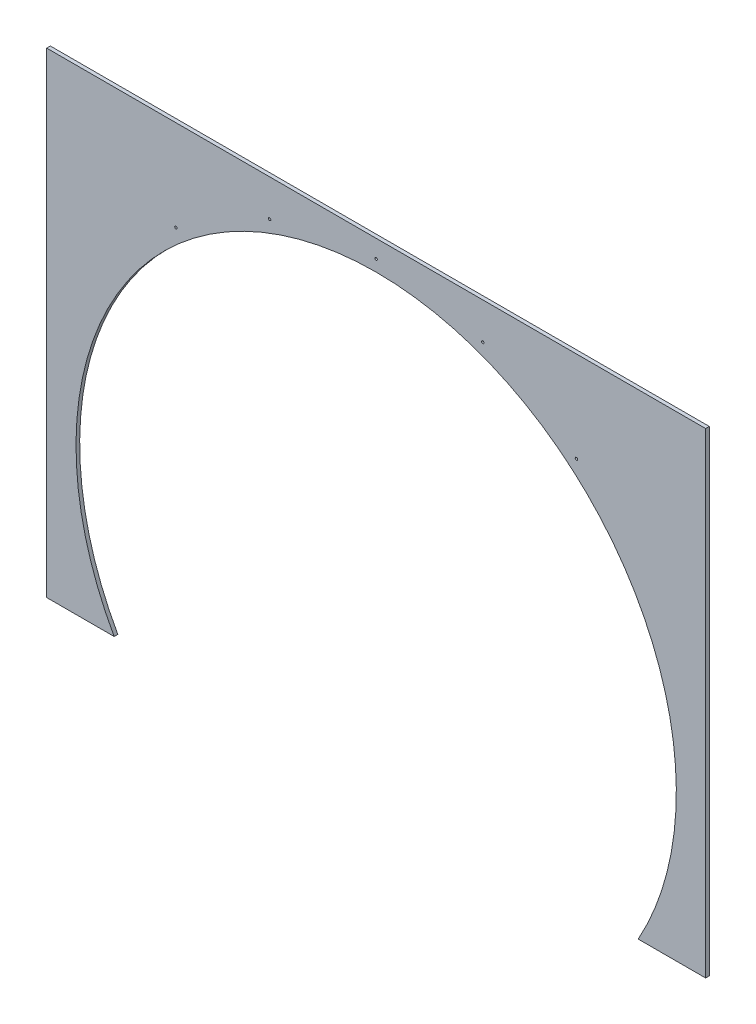
ISO-10303-21;
HEADER;
FILE_DESCRIPTION(('STEP AP214'),'2;1');
FILE_NAME('part.step','',(''),(''),'','','');
FILE_SCHEMA(('AUTOMOTIVE_DESIGN { 1 0 10303 214 1 1 1 1 }'));
ENDSEC;
DATA;
#1=APPLICATION_CONTEXT('core data for automotive mechanical design processes');
#2=APPLICATION_PROTOCOL_DEFINITION('international standard','automotive_design',2000,#1);
#3=PRODUCT_CONTEXT('',#1,'mechanical');
#4=PRODUCT('Part','Part','',(#3));
#5=PRODUCT_RELATED_PRODUCT_CATEGORY('part','',(#4));
#6=PRODUCT_DEFINITION_FORMATION('','',#4);
#7=PRODUCT_DEFINITION_CONTEXT('part definition',#1,'design');
#8=PRODUCT_DEFINITION('design','',#6,#7);
#9=PRODUCT_DEFINITION_SHAPE('','',#8);
#10=(LENGTH_UNIT() NAMED_UNIT(*) SI_UNIT(.MILLI.,.METRE.));
#11=(NAMED_UNIT(*) PLANE_ANGLE_UNIT() SI_UNIT($,.RADIAN.));
#12=(NAMED_UNIT(*) SI_UNIT($,.STERADIAN.) SOLID_ANGLE_UNIT());
#13=UNCERTAINTY_MEASURE_WITH_UNIT(LENGTH_MEASURE(1.E-05),#10,'distance_accuracy_value','');
#14=(GEOMETRIC_REPRESENTATION_CONTEXT(3) GLOBAL_UNCERTAINTY_ASSIGNED_CONTEXT((#13)) GLOBAL_UNIT_ASSIGNED_CONTEXT((#10,
#11,#12)) REPRESENTATION_CONTEXT('',''));
#15=CARTESIAN_POINT('',(0.,0.,0.));
#16=DIRECTION('',(0.,0.,1.));
#17=DIRECTION('',(1.,0.,0.));
#18=AXIS2_PLACEMENT_3D('',#15,#16,#17);
#19=CARTESIAN_POINT('',(0.,400.,10.));
#20=DIRECTION('',(0.,0.,1.));
#21=DIRECTION('',(1.,0.,0.));
#22=AXIS2_PLACEMENT_3D('',#19,#20,#21);
#23=PLANE('',#22);
#24=CARTESIAN_POINT('',(-291.096591753976,1199.78131272425,10.));
#25=DIRECTION('',(0.,0.,1.));
#26=DIRECTION('',(1.,0.,0.));
#27=AXIS2_PLACEMENT_3D('',#24,#25,#26);
#28=CIRCLE('',#27,3.29999999999997);
#29=CARTESIAN_POINT('',(-287.796591753976,1199.78131272425,10.));
#30=VERTEX_POINT('',#29);
#31=EDGE_CURVE('E149',#30,#30,#28,.F.);
#32=ORIENTED_EDGE('',*,*,#31,.T.);
#33=EDGE_LOOP('',(#32));
#34=FACE_BOUND('',#33,.T.);
#35=DIRECTION('',(0.,-1.,0.));
#36=VECTOR('',#35,1.);
#37=CARTESIAN_POINT('',(-900.,0.,10.));
#38=LINE('',#37,#36);
#39=CARTESIAN_POINT('',(-900.,1300.,10.));
#40=VERTEX_POINT('',#39);
#41=CARTESIAN_POINT('',(-900.,0.,10.));
#42=VERTEX_POINT('',#41);
#43=EDGE_CURVE('E131',#40,#42,#38,.T.);
#44=ORIENTED_EDGE('',*,*,#43,.T.);
#45=DIRECTION('',(1.,0.,0.));
#46=VECTOR('',#45,1.);
#47=CARTESIAN_POINT('',(-900.,0.,10.));
#48=LINE('',#47,#46);
#49=CARTESIAN_POINT('',(-715.821206726931,0.,10.));
#50=VERTEX_POINT('',#49);
#51=EDGE_CURVE('E89',#42,#50,#48,.T.);
#52=ORIENTED_EDGE('',*,*,#51,.T.);
#53=CARTESIAN_POINT('',(0.,400.,10.));
#54=DIRECTION('',(0.,0.,-1.));
#55=DIRECTION('',(1.,0.,0.));
#56=AXIS2_PLACEMENT_3D('',#53,#54,#55);
#57=CIRCLE('',#56,820.);
#58=CARTESIAN_POINT('',(715.821206726931,-3.88578058618805E-13,10.));
#59=VERTEX_POINT('',#58);
#60=EDGE_CURVE('E102',#50,#59,#57,.T.);
#61=ORIENTED_EDGE('',*,*,#60,.T.);
#62=DIRECTION('',(1.,0.,0.));
#63=VECTOR('',#62,1.);
#64=CARTESIAN_POINT('',(715.821206726931,0.,10.));
#65=LINE('',#64,#63);
#66=CARTESIAN_POINT('',(900.,0.,10.));
#67=VERTEX_POINT('',#66);
#68=EDGE_CURVE('E96',#59,#67,#65,.T.);
#69=ORIENTED_EDGE('',*,*,#68,.T.);
#70=DIRECTION('',(0.,1.,0.));
#71=VECTOR('',#70,1.);
#72=CARTESIAN_POINT('',(900.,0.,10.));
#73=LINE('',#72,#71);
#74=CARTESIAN_POINT('',(900.,1300.,10.));
#75=VERTEX_POINT('',#74);
#76=EDGE_CURVE('E100',#67,#75,#73,.T.);
#77=ORIENTED_EDGE('',*,*,#76,.T.);
#78=DIRECTION('',(-1.,0.,0.));
#79=VECTOR('',#78,1.);
#80=CARTESIAN_POINT('',(-900.,1300.,10.));
#81=LINE('',#80,#79);
#82=EDGE_CURVE('E52',#75,#40,#81,.T.);
#83=ORIENTED_EDGE('',*,*,#82,.T.);
#84=EDGE_LOOP('',(#44,#52,#61,#69,#77,#83));
#85=FACE_BOUND('',#84,.T.);
#86=CARTESIAN_POINT('',(547.082638414246,1051.98769977608,10.));
#87=DIRECTION('',(0.,0.,1.));
#88=DIRECTION('',(1.,0.,0.));
#89=AXIS2_PLACEMENT_3D('',#86,#87,#88);
#90=CIRCLE('',#89,3.29999999999997);
#91=CARTESIAN_POINT('',(550.382638414246,1051.98769977608,10.));
#92=VERTEX_POINT('',#91);
#93=EDGE_CURVE('E139',#92,#92,#90,.F.);
#94=ORIENTED_EDGE('',*,*,#93,.T.);
#95=EDGE_LOOP('',(#94));
#96=FACE_BOUND('',#95,.T.);
#97=CARTESIAN_POINT('',(291.096591753964,1199.78131272422,10.));
#98=DIRECTION('',(0.,0.,1.));
#99=DIRECTION('',(1.,0.,0.));
#100=AXIS2_PLACEMENT_3D('',#97,#98,#99);
#101=CIRCLE('',#100,3.29999999999997);
#102=CARTESIAN_POINT('',(294.396591753964,1199.78131272422,10.));
#103=VERTEX_POINT('',#102);
#104=EDGE_CURVE('E143',#103,#103,#101,.F.);
#105=ORIENTED_EDGE('',*,*,#104,.T.);
#106=EDGE_LOOP('',(#105));
#107=FACE_BOUND('',#106,.T.);
#108=CARTESIAN_POINT('',(-547.082638414294,1051.98769977616,10.));
#109=DIRECTION('',(0.,0.,1.));
#110=DIRECTION('',(1.,0.,0.));
#111=AXIS2_PLACEMENT_3D('',#108,#109,#110);
#112=CIRCLE('',#111,3.29999999999997);
#113=CARTESIAN_POINT('',(-543.782638414294,1051.98769977616,10.));
#114=VERTEX_POINT('',#113);
#115=EDGE_CURVE('E146',#114,#114,#112,.F.);
#116=ORIENTED_EDGE('',*,*,#115,.T.);
#117=EDGE_LOOP('',(#116));
#118=FACE_BOUND('',#117,.T.);
#119=CARTESIAN_POINT('',(0.,1251.10949584275,10.));
#120=DIRECTION('',(0.,0.,1.));
#121=DIRECTION('',(1.,0.,0.));
#122=AXIS2_PLACEMENT_3D('',#119,#120,#121);
#123=CIRCLE('',#122,3.29999999999999);
#124=CARTESIAN_POINT('',(3.30000000000002,1251.10949584275,10.));
#125=VERTEX_POINT('',#124);
#126=EDGE_CURVE('E159',#125,#125,#123,.F.);
#127=ORIENTED_EDGE('',*,*,#126,.T.);
#128=EDGE_LOOP('',(#127));
#129=FACE_BOUND('',#128,.T.);
#130=ADVANCED_FACE('F33',(#34,#85,#96,#107,#118,#129),#23,.T.);
#131=CARTESIAN_POINT('',(-900.,0.,10.));
#132=DIRECTION('',(1.,0.,0.));
#133=DIRECTION('',(0.,0.,-1.));
#134=AXIS2_PLACEMENT_3D('',#131,#132,#133);
#135=PLANE('',#134);
#136=DIRECTION('',(0.,-1.,0.));
#137=VECTOR('',#136,1.);
#138=CARTESIAN_POINT('',(-900.,0.,0.));
#139=LINE('',#138,#137);
#140=CARTESIAN_POINT('',(-900.,1300.,0.));
#141=VERTEX_POINT('',#140);
#142=CARTESIAN_POINT('',(-900.,0.,0.));
#143=VERTEX_POINT('',#142);
#144=EDGE_CURVE('E120',#141,#143,#139,.T.);
#145=ORIENTED_EDGE('',*,*,#144,.T.);
#146=DIRECTION('',(0.,0.,-1.));
#147=VECTOR('',#146,1.);
#148=CARTESIAN_POINT('',(-900.,0.,10.));
#149=LINE('',#148,#147);
#150=EDGE_CURVE('E11',#42,#143,#149,.T.);
#151=ORIENTED_EDGE('',*,*,#150,.F.);
#152=ORIENTED_EDGE('',*,*,#43,.F.);
#153=DIRECTION('',(0.,0.,-1.));
#154=VECTOR('',#153,1.);
#155=CARTESIAN_POINT('',(-900.,1300.,10.));
#156=LINE('',#155,#154);
#157=EDGE_CURVE('E116',#40,#141,#156,.T.);
#158=ORIENTED_EDGE('',*,*,#157,.T.);
#159=EDGE_LOOP('',(#145,#151,#152,#158));
#160=FACE_BOUND('',#159,.T.);
#161=ADVANCED_FACE('F35',(#160),#135,.F.);
#162=CARTESIAN_POINT('',(-900.,0.,10.));
#163=DIRECTION('',(0.,1.,0.));
#164=DIRECTION('',(-1.,0.,0.));
#165=AXIS2_PLACEMENT_3D('',#162,#163,#164);
#166=PLANE('',#165);
#167=DIRECTION('',(1.,0.,0.));
#168=VECTOR('',#167,1.);
#169=CARTESIAN_POINT('',(-900.,0.,0.));
#170=LINE('',#169,#168);
#171=CARTESIAN_POINT('',(-715.821206726931,0.,0.));
#172=VERTEX_POINT('',#171);
#173=EDGE_CURVE('E123',#143,#172,#170,.T.);
#174=ORIENTED_EDGE('',*,*,#173,.T.);
#175=DIRECTION('',(0.,0.,-1.));
#176=VECTOR('',#175,1.);
#177=CARTESIAN_POINT('',(-715.821206726931,0.,10.));
#178=LINE('',#177,#176);
#179=EDGE_CURVE('E43',#50,#172,#178,.T.);
#180=ORIENTED_EDGE('',*,*,#179,.F.);
#181=ORIENTED_EDGE('',*,*,#51,.F.);
#182=ORIENTED_EDGE('',*,*,#150,.T.);
#183=EDGE_LOOP('',(#174,#180,#181,#182));
#184=FACE_BOUND('',#183,.T.);
#185=ADVANCED_FACE('F169',(#184),#166,.F.);
#186=CARTESIAN_POINT('',(0.,400.,10.));
#187=DIRECTION('',(0.,0.,-1.));
#188=DIRECTION('',(-1.,0.,0.));
#189=AXIS2_PLACEMENT_3D('',#186,#187,#188);
#190=CYLINDRICAL_SURFACE('',#189,820.);
#191=CARTESIAN_POINT('',(0.,400.,0.));
#192=DIRECTION('',(0.,0.,-1.));
#193=DIRECTION('',(1.,0.,0.));
#194=AXIS2_PLACEMENT_3D('',#191,#192,#193);
#195=CIRCLE('',#194,820.);
#196=CARTESIAN_POINT('',(715.821206726931,-3.88578058618805E-13,0.));
#197=VERTEX_POINT('',#196);
#198=EDGE_CURVE('E126',#172,#197,#195,.T.);
#199=ORIENTED_EDGE('',*,*,#198,.T.);
#200=DIRECTION('',(0.,0.,-1.));
#201=VECTOR('',#200,1.);
#202=CARTESIAN_POINT('',(715.821206726931,-3.88578058618805E-13,10.));
#203=LINE('',#202,#201);
#204=EDGE_CURVE('E111',#59,#197,#203,.T.);
#205=ORIENTED_EDGE('',*,*,#204,.F.);
#206=ORIENTED_EDGE('',*,*,#60,.F.);
#207=ORIENTED_EDGE('',*,*,#179,.T.);
#208=EDGE_LOOP('',(#199,#205,#206,#207));
#209=FACE_BOUND('',#208,.T.);
#210=ADVANCED_FACE('F172',(#209),#190,.F.);
#211=CARTESIAN_POINT('',(715.821206726931,0.,10.));
#212=DIRECTION('',(0.,1.,0.));
#213=DIRECTION('',(-1.,0.,0.));
#214=AXIS2_PLACEMENT_3D('',#211,#212,#213);
#215=PLANE('',#214);
#216=DIRECTION('',(1.,0.,0.));
#217=VECTOR('',#216,1.);
#218=CARTESIAN_POINT('',(715.821206726931,0.,0.));
#219=LINE('',#218,#217);
#220=CARTESIAN_POINT('',(900.,0.,0.));
#221=VERTEX_POINT('',#220);
#222=EDGE_CURVE('E110',#197,#221,#219,.T.);
#223=ORIENTED_EDGE('',*,*,#222,.T.);
#224=DIRECTION('',(0.,0.,-1.));
#225=VECTOR('',#224,1.);
#226=CARTESIAN_POINT('',(900.,0.,10.));
#227=LINE('',#226,#225);
#228=EDGE_CURVE('E107',#67,#221,#227,.T.);
#229=ORIENTED_EDGE('',*,*,#228,.F.);
#230=ORIENTED_EDGE('',*,*,#68,.F.);
#231=ORIENTED_EDGE('',*,*,#204,.T.);
#232=EDGE_LOOP('',(#223,#229,#230,#231));
#233=FACE_BOUND('',#232,.T.);
#234=ADVANCED_FACE('F108',(#233),#215,.F.);
#235=CARTESIAN_POINT('',(900.,0.,10.));
#236=DIRECTION('',(-1.,0.,0.));
#237=DIRECTION('',(0.,0.,1.));
#238=AXIS2_PLACEMENT_3D('',#235,#236,#237);
#239=PLANE('',#238);
#240=DIRECTION('',(0.,1.,0.));
#241=VECTOR('',#240,1.);
#242=CARTESIAN_POINT('',(900.,0.,0.));
#243=LINE('',#242,#241);
#244=CARTESIAN_POINT('',(900.,1300.,0.));
#245=VERTEX_POINT('',#244);
#246=EDGE_CURVE('E75',#221,#245,#243,.T.);
#247=ORIENTED_EDGE('',*,*,#246,.T.);
#248=DIRECTION('',(0.,0.,-1.));
#249=VECTOR('',#248,1.);
#250=CARTESIAN_POINT('',(900.,1300.,10.));
#251=LINE('',#250,#249);
#252=EDGE_CURVE('E112',#75,#245,#251,.T.);
#253=ORIENTED_EDGE('',*,*,#252,.F.);
#254=ORIENTED_EDGE('',*,*,#76,.F.);
#255=ORIENTED_EDGE('',*,*,#228,.T.);
#256=EDGE_LOOP('',(#247,#253,#254,#255));
#257=FACE_BOUND('',#256,.T.);
#258=ADVANCED_FACE('F114',(#257),#239,.F.);
#259=CARTESIAN_POINT('',(-900.,1300.,10.));
#260=DIRECTION('',(0.,-1.,0.));
#261=DIRECTION('',(0.,0.,-1.));
#262=AXIS2_PLACEMENT_3D('',#259,#260,#261);
#263=PLANE('',#262);
#264=DIRECTION('',(-1.,0.,0.));
#265=VECTOR('',#264,1.);
#266=CARTESIAN_POINT('',(-900.,1300.,0.));
#267=LINE('',#266,#265);
#268=EDGE_CURVE('E81',#245,#141,#267,.T.);
#269=ORIENTED_EDGE('',*,*,#268,.T.);
#270=ORIENTED_EDGE('',*,*,#157,.F.);
#271=ORIENTED_EDGE('',*,*,#82,.F.);
#272=ORIENTED_EDGE('',*,*,#252,.T.);
#273=EDGE_LOOP('',(#269,#270,#271,#272));
#274=FACE_BOUND('',#273,.T.);
#275=ADVANCED_FACE('F177',(#274),#263,.F.);
#276=CARTESIAN_POINT('',(0.,400.,0.));
#277=DIRECTION('',(0.,0.,1.));
#278=DIRECTION('',(1.,0.,0.));
#279=AXIS2_PLACEMENT_3D('',#276,#277,#278);
#280=PLANE('',#279);
#281=CARTESIAN_POINT('',(0.,1251.10949584275,0.));
#282=DIRECTION('',(0.,0.,1.));
#283=DIRECTION('',(1.,0.,0.));
#284=AXIS2_PLACEMENT_3D('',#281,#282,#283);
#285=CIRCLE('',#284,3.29999999999999);
#286=CARTESIAN_POINT('',(3.30000000000002,1251.10949584275,0.));
#287=VERTEX_POINT('',#286);
#288=EDGE_CURVE('E37',#287,#287,#285,.T.);
#289=ORIENTED_EDGE('',*,*,#288,.T.);
#290=EDGE_LOOP('',(#289));
#291=FACE_BOUND('',#290,.T.);
#292=CARTESIAN_POINT('',(-291.096591753976,1199.78131272425,0.));
#293=DIRECTION('',(0.,0.,1.));
#294=DIRECTION('',(1.,0.,0.));
#295=AXIS2_PLACEMENT_3D('',#292,#293,#294);
#296=CIRCLE('',#295,3.29999999999997);
#297=CARTESIAN_POINT('',(-287.796591753976,1199.78131272425,0.));
#298=VERTEX_POINT('',#297);
#299=EDGE_CURVE('E147',#298,#298,#296,.T.);
#300=ORIENTED_EDGE('',*,*,#299,.T.);
#301=EDGE_LOOP('',(#300));
#302=FACE_BOUND('',#301,.T.);
#303=CARTESIAN_POINT('',(-547.082638414294,1051.98769977616,0.));
#304=DIRECTION('',(0.,0.,1.));
#305=DIRECTION('',(1.,0.,0.));
#306=AXIS2_PLACEMENT_3D('',#303,#304,#305);
#307=CIRCLE('',#306,3.29999999999997);
#308=CARTESIAN_POINT('',(-543.782638414294,1051.98769977616,0.));
#309=VERTEX_POINT('',#308);
#310=EDGE_CURVE('E144',#309,#309,#307,.T.);
#311=ORIENTED_EDGE('',*,*,#310,.T.);
#312=EDGE_LOOP('',(#311));
#313=FACE_BOUND('',#312,.T.);
#314=CARTESIAN_POINT('',(291.096591753964,1199.78131272422,0.));
#315=DIRECTION('',(0.,0.,1.));
#316=DIRECTION('',(1.,0.,0.));
#317=AXIS2_PLACEMENT_3D('',#314,#315,#316);
#318=CIRCLE('',#317,3.29999999999997);
#319=CARTESIAN_POINT('',(294.396591753964,1199.78131272422,0.));
#320=VERTEX_POINT('',#319);
#321=EDGE_CURVE('E140',#320,#320,#318,.T.);
#322=ORIENTED_EDGE('',*,*,#321,.T.);
#323=EDGE_LOOP('',(#322));
#324=FACE_BOUND('',#323,.T.);
#325=CARTESIAN_POINT('',(547.082638414246,1051.98769977608,0.));
#326=DIRECTION('',(0.,0.,1.));
#327=DIRECTION('',(1.,0.,0.));
#328=AXIS2_PLACEMENT_3D('',#325,#326,#327);
#329=CIRCLE('',#328,3.29999999999997);
#330=CARTESIAN_POINT('',(550.382638414246,1051.98769977608,0.));
#331=VERTEX_POINT('',#330);
#332=EDGE_CURVE('E124',#331,#331,#329,.T.);
#333=ORIENTED_EDGE('',*,*,#332,.T.);
#334=EDGE_LOOP('',(#333));
#335=FACE_BOUND('',#334,.T.);
#336=ORIENTED_EDGE('',*,*,#144,.F.);
#337=ORIENTED_EDGE('',*,*,#268,.F.);
#338=ORIENTED_EDGE('',*,*,#246,.F.);
#339=ORIENTED_EDGE('',*,*,#222,.F.);
#340=ORIENTED_EDGE('',*,*,#198,.F.);
#341=ORIENTED_EDGE('',*,*,#173,.F.);
#342=EDGE_LOOP('',(#336,#337,#338,#339,#340,#341));
#343=FACE_BOUND('',#342,.T.);
#344=ADVANCED_FACE('F175',(#291,#302,#313,#324,#335,#343),#280,.F.);
#345=CARTESIAN_POINT('',(547.082638414246,1051.98769977608,-5.99999999999976));
#346=DIRECTION('',(0.,0.,-1.));
#347=DIRECTION('',(0.,1.,0.));
#348=AXIS2_PLACEMENT_3D('',#345,#346,#347);
#349=CYLINDRICAL_SURFACE('',#348,3.29999999999997);
#350=ORIENTED_EDGE('',*,*,#93,.F.);
#351=EDGE_LOOP('',(#350));
#352=FACE_BOUND('',#351,.T.);
#353=ORIENTED_EDGE('',*,*,#332,.F.);
#354=EDGE_LOOP('',(#353));
#355=FACE_BOUND('',#354,.T.);
#356=ADVANCED_FACE('F184',(#352,#355),#349,.F.);
#357=CARTESIAN_POINT('',(291.096591753964,1199.78131272422,-5.99999999999977));
#358=DIRECTION('',(0.,0.,-1.));
#359=DIRECTION('',(0.,1.,0.));
#360=AXIS2_PLACEMENT_3D('',#357,#358,#359);
#361=CYLINDRICAL_SURFACE('',#360,3.29999999999997);
#362=ORIENTED_EDGE('',*,*,#104,.F.);
#363=EDGE_LOOP('',(#362));
#364=FACE_BOUND('',#363,.T.);
#365=ORIENTED_EDGE('',*,*,#321,.F.);
#366=EDGE_LOOP('',(#365));
#367=FACE_BOUND('',#366,.T.);
#368=ADVANCED_FACE('F196',(#364,#367),#361,.F.);
#369=CARTESIAN_POINT('',(-547.082638414294,1051.98769977616,-5.99999999999985));
#370=DIRECTION('',(0.,0.,-1.));
#371=DIRECTION('',(0.,1.,0.));
#372=AXIS2_PLACEMENT_3D('',#369,#370,#371);
#373=CYLINDRICAL_SURFACE('',#372,3.29999999999997);
#374=ORIENTED_EDGE('',*,*,#115,.F.);
#375=EDGE_LOOP('',(#374));
#376=FACE_BOUND('',#375,.T.);
#377=ORIENTED_EDGE('',*,*,#310,.F.);
#378=EDGE_LOOP('',(#377));
#379=FACE_BOUND('',#378,.T.);
#380=ADVANCED_FACE('F200',(#376,#379),#373,.F.);
#381=CARTESIAN_POINT('',(-291.096591753976,1199.78131272425,-5.99999999999982));
#382=DIRECTION('',(0.,0.,-1.));
#383=DIRECTION('',(0.,1.,0.));
#384=AXIS2_PLACEMENT_3D('',#381,#382,#383);
#385=CYLINDRICAL_SURFACE('',#384,3.29999999999997);
#386=ORIENTED_EDGE('',*,*,#31,.F.);
#387=EDGE_LOOP('',(#386));
#388=FACE_BOUND('',#387,.T.);
#389=ORIENTED_EDGE('',*,*,#299,.F.);
#390=EDGE_LOOP('',(#389));
#391=FACE_BOUND('',#390,.T.);
#392=ADVANCED_FACE('F204',(#388,#391),#385,.F.);
#393=CARTESIAN_POINT('',(0.,1251.10949584275,-5.99999999999979));
#394=DIRECTION('',(0.,0.,-1.));
#395=DIRECTION('',(0.,1.,0.));
#396=AXIS2_PLACEMENT_3D('',#393,#394,#395);
#397=CYLINDRICAL_SURFACE('',#396,3.29999999999999);
#398=ORIENTED_EDGE('',*,*,#126,.F.);
#399=EDGE_LOOP('',(#398));
#400=FACE_BOUND('',#399,.T.);
#401=ORIENTED_EDGE('',*,*,#288,.F.);
#402=EDGE_LOOP('',(#401));
#403=FACE_BOUND('',#402,.T.);
#404=ADVANCED_FACE('F208',(#400,#403),#397,.F.);
#405=CLOSED_SHELL('',(#130,#161,#185,#210,#234,#258,#275,#344,#356,#368,#380,#392,#404));
#406=MANIFOLD_SOLID_BREP('B2',#405);
#407=ADVANCED_BREP_SHAPE_REPRESENTATION('',(#18,#406),#14);
#408=SHAPE_DEFINITION_REPRESENTATION(#9,#407);
ENDSEC;
END-ISO-10303-21;
